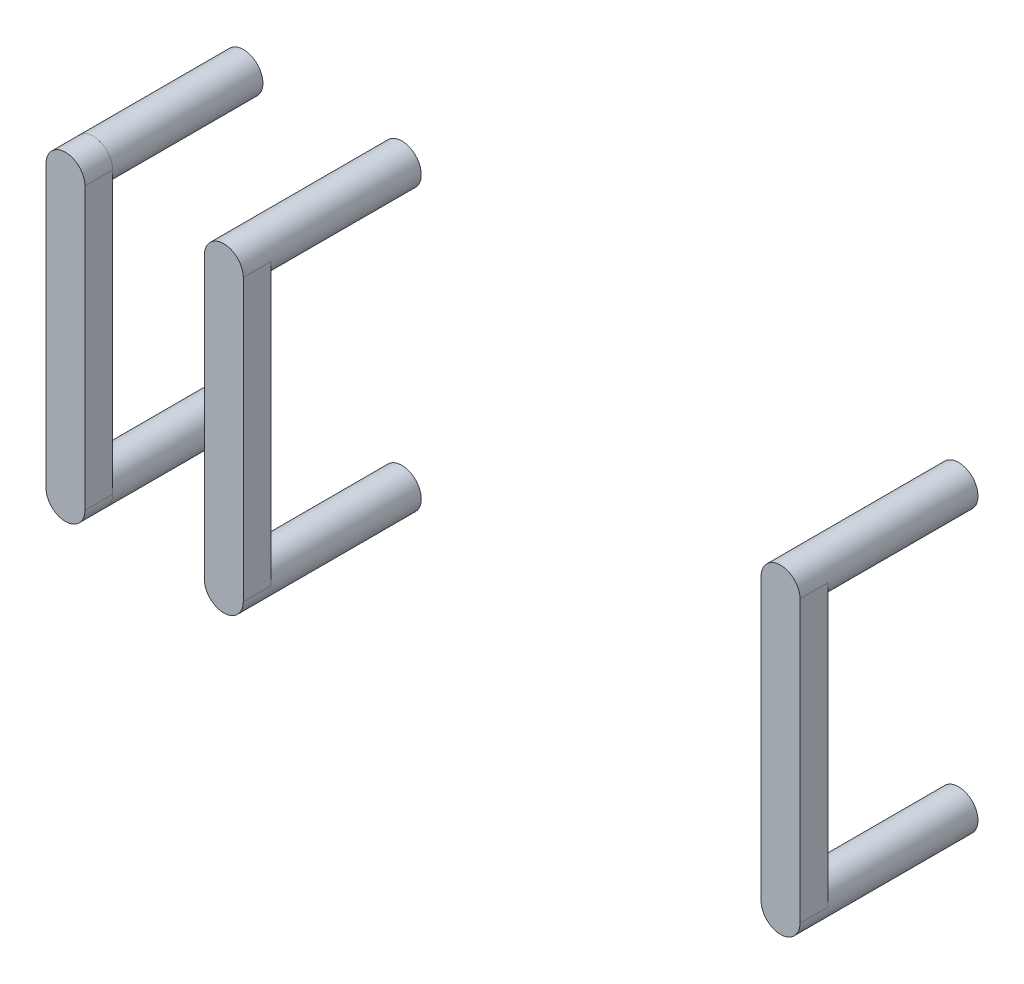
ISO-10303-21;
HEADER;
FILE_DESCRIPTION(('STEP AP214'),'2;1');
FILE_NAME('part.step','',(''),(''),'','','');
FILE_SCHEMA(('AUTOMOTIVE_DESIGN { 1 0 10303 214 1 1 1 1 }'));
ENDSEC;
DATA;
#1=APPLICATION_CONTEXT('core data for automotive mechanical design processes');
#2=APPLICATION_PROTOCOL_DEFINITION('international standard','automotive_design',2000,#1);
#3=PRODUCT_CONTEXT('',#1,'mechanical');
#4=PRODUCT('Part','Part','',(#3));
#5=PRODUCT_RELATED_PRODUCT_CATEGORY('part','',(#4));
#6=PRODUCT_DEFINITION_FORMATION('','',#4);
#7=PRODUCT_DEFINITION_CONTEXT('part definition',#1,'design');
#8=PRODUCT_DEFINITION('design','',#6,#7);
#9=PRODUCT_DEFINITION_SHAPE('','',#8);
#10=(LENGTH_UNIT() NAMED_UNIT(*) SI_UNIT(.MILLI.,.METRE.));
#11=(NAMED_UNIT(*) PLANE_ANGLE_UNIT() SI_UNIT($,.RADIAN.));
#12=(NAMED_UNIT(*) SI_UNIT($,.STERADIAN.) SOLID_ANGLE_UNIT());
#13=UNCERTAINTY_MEASURE_WITH_UNIT(LENGTH_MEASURE(1.E-05),#10,'distance_accuracy_value','');
#14=(GEOMETRIC_REPRESENTATION_CONTEXT(3) GLOBAL_UNCERTAINTY_ASSIGNED_CONTEXT((#13)) GLOBAL_UNIT_ASSIGNED_CONTEXT((#10,
#11,#12)) REPRESENTATION_CONTEXT('',''));
#15=CARTESIAN_POINT('',(0.,0.,0.));
#16=DIRECTION('',(0.,0.,1.));
#17=DIRECTION('',(1.,0.,0.));
#18=AXIS2_PLACEMENT_3D('',#15,#16,#17);
#19=CARTESIAN_POINT('',(-78.5249999999999,-80.2018973444951,31.9999999999999));
#20=DIRECTION('',(0.,0.,-1.));
#21=DIRECTION('',(-1.,0.,0.));
#22=AXIS2_PLACEMENT_3D('',#19,#20,#21);
#23=CYLINDRICAL_SURFACE('',#22,3.5);
#24=CARTESIAN_POINT('',(-78.5249999999999,-80.2018973444951,26.9999999999999));
#25=DIRECTION('',(0.,0.,1.));
#26=DIRECTION('',(-1.,0.,0.));
#27=AXIS2_PLACEMENT_3D('',#24,#25,#26);
#28=CIRCLE('',#27,3.5);
#29=CARTESIAN_POINT('',(-82.0249999999999,-80.2018973444951,26.9999999999999));
#30=VERTEX_POINT('',#29);
#31=CARTESIAN_POINT('',(-75.0249999999999,-80.2018973444951,26.9999999999999));
#32=VERTEX_POINT('',#31);
#33=EDGE_CURVE('E12',#30,#32,#28,.T.);
#34=ORIENTED_EDGE('',*,*,#33,.T.);
#35=DIRECTION('',(0.,0.,-1.));
#36=VECTOR('',#35,1.);
#37=CARTESIAN_POINT('',(-75.0249999999999,-80.2018973444951,31.9999999999999));
#38=LINE('',#37,#36);
#39=CARTESIAN_POINT('',(-75.0249999999999,-80.2018973444951,31.9999999999999));
#40=VERTEX_POINT('',#39);
#41=EDGE_CURVE('E117',#40,#32,#38,.T.);
#42=ORIENTED_EDGE('',*,*,#41,.F.);
#43=CARTESIAN_POINT('',(-78.5249999999999,-80.2018973444951,31.9999999999999));
#44=DIRECTION('',(0.,0.,1.));
#45=DIRECTION('',(-1.,0.,0.));
#46=AXIS2_PLACEMENT_3D('',#43,#44,#45);
#47=CIRCLE('',#46,3.5);
#48=CARTESIAN_POINT('',(-82.0249999999999,-80.2018973444951,31.9999999999999));
#49=VERTEX_POINT('',#48);
#50=EDGE_CURVE('E50',#49,#40,#47,.T.);
#51=ORIENTED_EDGE('',*,*,#50,.F.);
#52=DIRECTION('',(0.,0.,-1.));
#53=VECTOR('',#52,1.);
#54=CARTESIAN_POINT('',(-82.0249999999999,-80.2018973444951,31.9999999999999));
#55=LINE('',#54,#53);
#56=EDGE_CURVE('E105',#49,#30,#55,.T.);
#57=ORIENTED_EDGE('',*,*,#56,.T.);
#58=EDGE_LOOP('',(#34,#42,#51,#57));
#59=FACE_BOUND('',#58,.T.);
#60=ADVANCED_FACE('F46',(#59),#23,.T.);
#61=CARTESIAN_POINT('',(-75.0249999999999,-80.2018973444951,31.9999999999999));
#62=DIRECTION('',(-1.,0.,0.));
#63=DIRECTION('',(0.,-1.,0.));
#64=AXIS2_PLACEMENT_3D('',#61,#62,#63);
#65=PLANE('',#64);
#66=DIRECTION('',(0.,1.,0.));
#67=VECTOR('',#66,1.);
#68=CARTESIAN_POINT('',(-75.0249999999999,-80.2018973444951,26.9999999999999));
#69=LINE('',#68,#67);
#70=CARTESIAN_POINT('',(-75.0249999999999,-29.6981026555043,26.9999999999999));
#71=VERTEX_POINT('',#70);
#72=EDGE_CURVE('E56',#32,#71,#69,.T.);
#73=ORIENTED_EDGE('',*,*,#72,.T.);
#74=DIRECTION('',(0.,0.,-1.));
#75=VECTOR('',#74,1.);
#76=CARTESIAN_POINT('',(-75.0249999999999,-29.6981026555043,31.9999999999999));
#77=LINE('',#76,#75);
#78=CARTESIAN_POINT('',(-75.0249999999999,-29.6981026555043,31.9999999999999));
#79=VERTEX_POINT('',#78);
#80=EDGE_CURVE('E101',#79,#71,#77,.T.);
#81=ORIENTED_EDGE('',*,*,#80,.F.);
#82=DIRECTION('',(0.,1.,0.));
#83=VECTOR('',#82,1.);
#84=CARTESIAN_POINT('',(-75.0249999999999,-80.2018973444951,31.9999999999999));
#85=LINE('',#84,#83);
#86=EDGE_CURVE('E80',#40,#79,#85,.T.);
#87=ORIENTED_EDGE('',*,*,#86,.F.);
#88=ORIENTED_EDGE('',*,*,#41,.T.);
#89=EDGE_LOOP('',(#73,#81,#87,#88));
#90=FACE_BOUND('',#89,.T.);
#91=ADVANCED_FACE('F120',(#90),#65,.F.);
#92=CARTESIAN_POINT('',(-78.5249999999999,-29.6981026555043,31.9999999999999));
#93=DIRECTION('',(0.,0.,-1.));
#94=DIRECTION('',(-1.,0.,0.));
#95=AXIS2_PLACEMENT_3D('',#92,#93,#94);
#96=CYLINDRICAL_SURFACE('',#95,3.5);
#97=CARTESIAN_POINT('',(-78.5249999999999,-29.6981026555043,26.9999999999999));
#98=DIRECTION('',(0.,0.,1.));
#99=DIRECTION('',(1.,0.,0.));
#100=AXIS2_PLACEMENT_3D('',#97,#98,#99);
#101=CIRCLE('',#100,3.5);
#102=CARTESIAN_POINT('',(-82.0249999999999,-29.6981026555043,26.9999999999999));
#103=VERTEX_POINT('',#102);
#104=EDGE_CURVE('E96',#71,#103,#101,.T.);
#105=ORIENTED_EDGE('',*,*,#104,.T.);
#106=DIRECTION('',(0.,0.,-1.));
#107=VECTOR('',#106,1.);
#108=CARTESIAN_POINT('',(-82.0249999999999,-29.6981026555043,31.9999999999999));
#109=LINE('',#108,#107);
#110=CARTESIAN_POINT('',(-82.0249999999999,-29.6981026555043,31.9999999999999));
#111=VERTEX_POINT('',#110);
#112=EDGE_CURVE('E99',#111,#103,#109,.T.);
#113=ORIENTED_EDGE('',*,*,#112,.F.);
#114=CARTESIAN_POINT('',(-78.5249999999999,-29.6981026555043,31.9999999999999));
#115=DIRECTION('',(0.,0.,1.));
#116=DIRECTION('',(1.,0.,0.));
#117=AXIS2_PLACEMENT_3D('',#114,#115,#116);
#118=CIRCLE('',#117,3.5);
#119=EDGE_CURVE('E113',#79,#111,#118,.T.);
#120=ORIENTED_EDGE('',*,*,#119,.F.);
#121=ORIENTED_EDGE('',*,*,#80,.T.);
#122=EDGE_LOOP('',(#105,#113,#120,#121));
#123=FACE_BOUND('',#122,.T.);
#124=ADVANCED_FACE('F97',(#123),#96,.T.);
#125=CARTESIAN_POINT('',(-82.0249999999999,-29.6981026555043,31.9999999999999));
#126=DIRECTION('',(1.,0.,0.));
#127=DIRECTION('',(0.,0.,-1.));
#128=AXIS2_PLACEMENT_3D('',#125,#126,#127);
#129=PLANE('',#128);
#130=DIRECTION('',(0.,-1.,0.));
#131=VECTOR('',#130,1.);
#132=CARTESIAN_POINT('',(-82.0249999999999,-29.6981026555043,26.9999999999999));
#133=LINE('',#132,#131);
#134=EDGE_CURVE('E90',#103,#30,#133,.T.);
#135=ORIENTED_EDGE('',*,*,#134,.T.);
#136=ORIENTED_EDGE('',*,*,#56,.F.);
#137=DIRECTION('',(0.,-1.,0.));
#138=VECTOR('',#137,1.);
#139=CARTESIAN_POINT('',(-82.0249999999999,-29.6981026555043,31.9999999999999));
#140=LINE('',#139,#138);
#141=EDGE_CURVE('E104',#111,#49,#140,.T.);
#142=ORIENTED_EDGE('',*,*,#141,.F.);
#143=ORIENTED_EDGE('',*,*,#112,.T.);
#144=EDGE_LOOP('',(#135,#136,#142,#143));
#145=FACE_BOUND('',#144,.T.);
#146=ADVANCED_FACE('F103',(#145),#129,.F.);
#147=CARTESIAN_POINT('',(-78.5249999999999,-80.2018973444951,31.9999999999999));
#148=DIRECTION('',(0.,0.,-1.));
#149=DIRECTION('',(-1.,0.,0.));
#150=AXIS2_PLACEMENT_3D('',#147,#148,#149);
#151=PLANE('',#150);
#152=ORIENTED_EDGE('',*,*,#50,.T.);
#153=ORIENTED_EDGE('',*,*,#86,.T.);
#154=ORIENTED_EDGE('',*,*,#119,.T.);
#155=ORIENTED_EDGE('',*,*,#141,.T.);
#156=EDGE_LOOP('',(#152,#153,#154,#155));
#157=FACE_BOUND('',#156,.T.);
#158=ADVANCED_FACE('F48',(#157),#151,.F.);
#159=CARTESIAN_POINT('',(-78.5249999999999,-80.2018973444951,26.9999999999999));
#160=DIRECTION('',(0.,0.,-1.));
#161=DIRECTION('',(-1.,0.,0.));
#162=AXIS2_PLACEMENT_3D('',#159,#160,#161);
#163=PLANE('',#162);
#164=ORIENTED_EDGE('',*,*,#33,.F.);
#165=ORIENTED_EDGE('',*,*,#134,.F.);
#166=ORIENTED_EDGE('',*,*,#104,.F.);
#167=ORIENTED_EDGE('',*,*,#72,.F.);
#168=EDGE_LOOP('',(#164,#165,#166,#167));
#169=FACE_BOUND('',#168,.T.);
#170=ADVANCED_FACE('F107',(#169),#163,.T.);
#171=CLOSED_SHELL('',(#60,#91,#124,#146,#158,#170));
#172=MANIFOLD_SOLID_BREP('B2',#171);
#173=CARTESIAN_POINT('',(-78.5249999999999,-29.6981026555043,36.8994949366116));
#174=DIRECTION('',(0.,0.,-1.));
#175=DIRECTION('',(-1.,0.,0.));
#176=AXIS2_PLACEMENT_3D('',#173,#174,#175);
#177=CYLINDRICAL_SURFACE('',#176,3.50000000000001);
#178=CARTESIAN_POINT('',(-78.5249999999999,-29.6981026555043,0.));
#179=DIRECTION('',(0.,0.,1.));
#180=DIRECTION('',(1.,0.,0.));
#181=AXIS2_PLACEMENT_3D('',#178,#179,#180);
#182=CIRCLE('',#181,3.50000000000001);
#183=CARTESIAN_POINT('',(-75.0249999999999,-29.6981026555043,0.));
#184=VERTEX_POINT('',#183);
#185=EDGE_CURVE('E45',#184,#184,#182,.T.);
#186=ORIENTED_EDGE('',*,*,#185,.T.);
#187=EDGE_LOOP('',(#186));
#188=FACE_BOUND('',#187,.T.);
#189=CARTESIAN_POINT('',(-78.5249999999999,-29.6981026555043,26.9999999999999));
#190=DIRECTION('',(0.,0.,1.));
#191=DIRECTION('',(1.,0.,0.));
#192=AXIS2_PLACEMENT_3D('',#189,#190,#191);
#193=CIRCLE('',#192,3.50000000000001);
#194=CARTESIAN_POINT('',(-75.0249999999999,-29.6981026555043,26.9999999999999));
#195=VERTEX_POINT('',#194);
#196=EDGE_CURVE('E197',#195,#195,#193,.T.);
#197=ORIENTED_EDGE('',*,*,#196,.F.);
#198=EDGE_LOOP('',(#197));
#199=FACE_BOUND('',#198,.T.);
#200=ADVANCED_FACE('F190',(#188,#199),#177,.T.);
#201=CARTESIAN_POINT('',(-78.5249999999999,-29.6981026555043,0.));
#202=DIRECTION('',(0.,0.,1.));
#203=DIRECTION('',(1.,0.,0.));
#204=AXIS2_PLACEMENT_3D('',#201,#202,#203);
#205=PLANE('',#204);
#206=ORIENTED_EDGE('',*,*,#185,.F.);
#207=EDGE_LOOP('',(#206));
#208=FACE_BOUND('',#207,.T.);
#209=ADVANCED_FACE('F192',(#208),#205,.F.);
#210=CARTESIAN_POINT('',(0.,-3.99999999999997,26.9999999999999));
#211=DIRECTION('',(0.,0.,1.));
#212=DIRECTION('',(1.,0.,0.));
#213=AXIS2_PLACEMENT_3D('',#210,#211,#212);
#214=PLANE('',#213);
#215=ORIENTED_EDGE('',*,*,#196,.T.);
#216=EDGE_LOOP('',(#215));
#217=FACE_BOUND('',#216,.T.);
#218=ADVANCED_FACE('F203',(#217),#214,.T.);
#219=CLOSED_SHELL('',(#200,#209,#218));
#220=MANIFOLD_SOLID_BREP('B6',#219);
#221=CARTESIAN_POINT('',(-78.5249999999999,-80.2018973444951,36.8994949366116));
#222=DIRECTION('',(0.,0.,-1.));
#223=DIRECTION('',(-1.,0.,0.));
#224=AXIS2_PLACEMENT_3D('',#221,#222,#223);
#225=CYLINDRICAL_SURFACE('',#224,3.50000000000001);
#226=CARTESIAN_POINT('',(-78.5249999999999,-80.2018973444951,0.));
#227=DIRECTION('',(0.,0.,1.));
#228=DIRECTION('',(-1.,0.,0.));
#229=AXIS2_PLACEMENT_3D('',#226,#227,#228);
#230=CIRCLE('',#229,3.50000000000001);
#231=CARTESIAN_POINT('',(-82.0249999999999,-80.2018973444951,0.));
#232=VERTEX_POINT('',#231);
#233=EDGE_CURVE('E189',#232,#232,#230,.T.);
#234=ORIENTED_EDGE('',*,*,#233,.T.);
#235=EDGE_LOOP('',(#234));
#236=FACE_BOUND('',#235,.T.);
#237=CARTESIAN_POINT('',(-78.5249999999999,-80.2018973444951,26.9999999999999));
#238=DIRECTION('',(0.,0.,1.));
#239=DIRECTION('',(1.,0.,0.));
#240=AXIS2_PLACEMENT_3D('',#237,#238,#239);
#241=CIRCLE('',#240,3.50000000000001);
#242=CARTESIAN_POINT('',(-75.0249999999999,-80.2018973444951,26.9999999999999));
#243=VERTEX_POINT('',#242);
#244=EDGE_CURVE('E254',#243,#243,#241,.T.);
#245=ORIENTED_EDGE('',*,*,#244,.F.);
#246=EDGE_LOOP('',(#245));
#247=FACE_BOUND('',#246,.T.);
#248=ADVANCED_FACE('F247',(#236,#247),#225,.T.);
#249=CARTESIAN_POINT('',(-78.5249999999999,-80.2018973444951,0.));
#250=DIRECTION('',(0.,0.,-1.));
#251=DIRECTION('',(-1.,0.,0.));
#252=AXIS2_PLACEMENT_3D('',#249,#250,#251);
#253=PLANE('',#252);
#254=ORIENTED_EDGE('',*,*,#233,.F.);
#255=EDGE_LOOP('',(#254));
#256=FACE_BOUND('',#255,.T.);
#257=ADVANCED_FACE('F249',(#256),#253,.T.);
#258=CARTESIAN_POINT('',(0.,-3.99999999999997,26.9999999999999));
#259=DIRECTION('',(0.,0.,1.));
#260=DIRECTION('',(1.,0.,0.));
#261=AXIS2_PLACEMENT_3D('',#258,#259,#260);
#262=PLANE('',#261);
#263=ORIENTED_EDGE('',*,*,#244,.T.);
#264=EDGE_LOOP('',(#263));
#265=FACE_BOUND('',#264,.T.);
#266=ADVANCED_FACE('F260',(#265),#262,.T.);
#267=CLOSED_SHELL('',(#248,#257,#266));
#268=MANIFOLD_SOLID_BREP('B40',#267);
#269=CARTESIAN_POINT('',(50.0500000000049,-80.2018973444951,26.9999999999999));
#270=DIRECTION('',(0.,0.,-1.));
#271=DIRECTION('',(-1.,0.,0.));
#272=AXIS2_PLACEMENT_3D('',#269,#270,#271);
#273=PLANE('',#272);
#274=DIRECTION('',(0.,-1.,0.));
#275=VECTOR('',#274,1.);
#276=CARTESIAN_POINT('',(46.5500000000049,-29.6981026555043,26.9999999999999));
#277=LINE('',#276,#275);
#278=CARTESIAN_POINT('',(46.5500000000049,-29.6981026555043,26.9999999999999));
#279=VERTEX_POINT('',#278);
#280=CARTESIAN_POINT('',(46.5500000000049,-80.2018973444951,26.9999999999999));
#281=VERTEX_POINT('',#280);
#282=EDGE_CURVE('E360',#279,#281,#277,.T.);
#283=ORIENTED_EDGE('',*,*,#282,.F.);
#284=CARTESIAN_POINT('',(50.050000000005,-29.6981026555043,26.9999999999999));
#285=DIRECTION('',(0.,0.,-1.));
#286=DIRECTION('',(-1.,0.,0.));
#287=AXIS2_PLACEMENT_3D('',#284,#285,#286);
#288=CIRCLE('',#287,3.5);
#289=CARTESIAN_POINT('',(53.550000000005,-29.6981026555043,26.9999999999999));
#290=VERTEX_POINT('',#289);
#291=EDGE_CURVE('E245',#279,#290,#288,.F.);
#292=ORIENTED_EDGE('',*,*,#291,.T.);
#293=DIRECTION('',(0.,1.,0.));
#294=VECTOR('',#293,1.);
#295=CARTESIAN_POINT('',(53.5500000000049,-80.2018973444951,26.9999999999999));
#296=LINE('',#295,#294);
#297=CARTESIAN_POINT('',(53.5500000000049,-80.2018973444951,26.9999999999999));
#298=VERTEX_POINT('',#297);
#299=EDGE_CURVE('E377',#298,#290,#296,.T.);
#300=ORIENTED_EDGE('',*,*,#299,.F.);
#301=CARTESIAN_POINT('',(50.050000000005,-80.2018973444951,26.9999999999999));
#302=DIRECTION('',(0.,0.,1.));
#303=DIRECTION('',(1.,0.,0.));
#304=AXIS2_PLACEMENT_3D('',#301,#302,#303);
#305=CIRCLE('',#304,3.5);
#306=EDGE_CURVE('E318',#298,#281,#305,.T.);
#307=ORIENTED_EDGE('',*,*,#306,.T.);
#308=EDGE_LOOP('',(#283,#292,#300,#307));
#309=FACE_BOUND('',#308,.T.);
#310=ADVANCED_FACE('F303',(#309),#273,.T.);
#311=CARTESIAN_POINT('',(50.050000000005,-80.2018973444951,36.8994949366116));
#312=DIRECTION('',(0.,0.,-1.));
#313=DIRECTION('',(-1.,0.,0.));
#314=AXIS2_PLACEMENT_3D('',#311,#312,#313);
#315=CYLINDRICAL_SURFACE('',#314,3.5);
#316=CARTESIAN_POINT('',(50.050000000005,-80.2018973444951,0.));
#317=DIRECTION('',(0.,0.,1.));
#318=DIRECTION('',(-1.,0.,0.));
#319=AXIS2_PLACEMENT_3D('',#316,#317,#318);
#320=CIRCLE('',#319,3.5);
#321=CARTESIAN_POINT('',(46.550000000005,-80.2018973444951,0.));
#322=VERTEX_POINT('',#321);
#323=EDGE_CURVE('E311',#322,#322,#320,.T.);
#324=ORIENTED_EDGE('',*,*,#323,.T.);
#325=EDGE_LOOP('',(#324));
#326=FACE_BOUND('',#325,.T.);
#327=ORIENTED_EDGE('',*,*,#306,.F.);
#328=DIRECTION('',(0.,0.,-1.));
#329=VECTOR('',#328,1.);
#330=CARTESIAN_POINT('',(53.5500000000049,-80.2018973444951,31.9999999999999));
#331=LINE('',#330,#329);
#332=CARTESIAN_POINT('',(53.5500000000049,-80.2018973444951,31.9999999999999));
#333=VERTEX_POINT('',#332);
#334=EDGE_CURVE('E347',#333,#298,#331,.T.);
#335=ORIENTED_EDGE('',*,*,#334,.F.);
#336=CARTESIAN_POINT('',(50.0500000000049,-80.2018973444951,31.9999999999999));
#337=DIRECTION('',(0.,0.,1.));
#338=DIRECTION('',(-1.,0.,0.));
#339=AXIS2_PLACEMENT_3D('',#336,#337,#338);
#340=CIRCLE('',#339,3.5);
#341=CARTESIAN_POINT('',(46.5500000000049,-80.2018973444951,31.9999999999999));
#342=VERTEX_POINT('',#341);
#343=EDGE_CURVE('E352',#342,#333,#340,.T.);
#344=ORIENTED_EDGE('',*,*,#343,.F.);
#345=DIRECTION('',(0.,0.,-1.));
#346=VECTOR('',#345,1.);
#347=CARTESIAN_POINT('',(46.5500000000049,-80.2018973444951,31.9999999999999));
#348=LINE('',#347,#346);
#349=EDGE_CURVE('E374',#342,#281,#348,.T.);
#350=ORIENTED_EDGE('',*,*,#349,.T.);
#351=EDGE_LOOP('',(#327,#335,#344,#350));
#352=FACE_BOUND('',#351,.T.);
#353=ADVANCED_FACE('F362',(#326,#352),#315,.T.);
#354=CARTESIAN_POINT('',(50.050000000005,-80.2018973444951,0.));
#355=DIRECTION('',(0.,0.,-1.));
#356=DIRECTION('',(-1.,0.,0.));
#357=AXIS2_PLACEMENT_3D('',#354,#355,#356);
#358=PLANE('',#357);
#359=CARTESIAN_POINT('',(50.0500000000049,-80.2018973444951,0.));
#360=DIRECTION('',(0.,0.,-1.));
#361=DIRECTION('',(1.,0.,0.));
#362=AXIS2_PLACEMENT_3D('',#359,#360,#361);
#363=CIRCLE('',#362,2.1);
#364=CARTESIAN_POINT('',(52.150000000005,-80.2018973444951,0.));
#365=VERTEX_POINT('',#364);
#366=EDGE_CURVE('E382',#365,#365,#363,.T.);
#367=ORIENTED_EDGE('',*,*,#366,.F.);
#368=EDGE_LOOP('',(#367));
#369=FACE_BOUND('',#368,.T.);
#370=ORIENTED_EDGE('',*,*,#323,.F.);
#371=EDGE_LOOP('',(#370));
#372=FACE_BOUND('',#371,.T.);
#373=ADVANCED_FACE('F305',(#369,#372),#358,.T.);
#374=CARTESIAN_POINT('',(50.0500000000049,-80.2018973444951,5.7));
#375=DIRECTION('',(0.,0.,-1.));
#376=DIRECTION('',(-1.,0.,0.));
#377=AXIS2_PLACEMENT_3D('',#374,#375,#376);
#378=CYLINDRICAL_SURFACE('',#377,2.1);
#379=CARTESIAN_POINT('',(50.0500000000049,-80.2018973444951,5.7));
#380=DIRECTION('',(0.,0.,-1.));
#381=DIRECTION('',(1.,0.,0.));
#382=AXIS2_PLACEMENT_3D('',#379,#380,#381);
#383=CIRCLE('',#382,2.1);
#384=CARTESIAN_POINT('',(52.150000000005,-80.2018973444951,5.7));
#385=VERTEX_POINT('',#384);
#386=EDGE_CURVE('E379',#385,#385,#383,.T.);
#387=ORIENTED_EDGE('',*,*,#386,.F.);
#388=EDGE_LOOP('',(#387));
#389=FACE_BOUND('',#388,.T.);
#390=ORIENTED_EDGE('',*,*,#366,.T.);
#391=EDGE_LOOP('',(#390));
#392=FACE_BOUND('',#391,.T.);
#393=ADVANCED_FACE('F392',(#389,#392),#378,.F.);
#394=CARTESIAN_POINT('',(50.0500000000049,-80.2018973444951,5.7));
#395=DIRECTION('',(0.,0.,1.));
#396=DIRECTION('',(1.,0.,0.));
#397=AXIS2_PLACEMENT_3D('',#394,#395,#396);
#398=PLANE('',#397);
#399=ORIENTED_EDGE('',*,*,#386,.T.);
#400=EDGE_LOOP('',(#399));
#401=FACE_BOUND('',#400,.T.);
#402=ADVANCED_FACE('F398',(#401),#398,.F.);
#403=CARTESIAN_POINT('',(53.5500000000049,-80.2018973444951,31.9999999999999));
#404=DIRECTION('',(-1.,0.,0.));
#405=DIRECTION('',(0.,-1.,0.));
#406=AXIS2_PLACEMENT_3D('',#403,#404,#405);
#407=PLANE('',#406);
#408=ORIENTED_EDGE('',*,*,#299,.T.);
#409=DIRECTION('',(0.,0.,-1.));
#410=VECTOR('',#409,1.);
#411=CARTESIAN_POINT('',(53.5500000000049,-29.6981026555043,31.9999999999999));
#412=LINE('',#411,#410);
#413=CARTESIAN_POINT('',(53.5500000000049,-29.6981026555043,31.9999999999999));
#414=VERTEX_POINT('',#413);
#415=EDGE_CURVE('E349',#414,#290,#412,.T.);
#416=ORIENTED_EDGE('',*,*,#415,.F.);
#417=DIRECTION('',(0.,1.,0.));
#418=VECTOR('',#417,1.);
#419=CARTESIAN_POINT('',(53.5500000000049,-80.2018973444951,31.9999999999999));
#420=LINE('',#419,#418);
#421=EDGE_CURVE('E343',#333,#414,#420,.T.);
#422=ORIENTED_EDGE('',*,*,#421,.F.);
#423=ORIENTED_EDGE('',*,*,#334,.T.);
#424=EDGE_LOOP('',(#408,#416,#422,#423));
#425=FACE_BOUND('',#424,.T.);
#426=ADVANCED_FACE('F346',(#425),#407,.F.);
#427=CARTESIAN_POINT('',(50.0500000000049,-29.6981026555043,31.9999999999999));
#428=DIRECTION('',(0.,0.,-1.));
#429=DIRECTION('',(-1.,0.,0.));
#430=AXIS2_PLACEMENT_3D('',#427,#428,#429);
#431=CYLINDRICAL_SURFACE('',#430,3.5);
#432=ORIENTED_EDGE('',*,*,#415,.T.);
#433=ORIENTED_EDGE('',*,*,#291,.F.);
#434=DIRECTION('',(0.,0.,-1.));
#435=VECTOR('',#434,1.);
#436=CARTESIAN_POINT('',(46.5500000000049,-29.6981026555043,31.9999999999999));
#437=LINE('',#436,#435);
#438=CARTESIAN_POINT('',(46.5500000000049,-29.6981026555043,31.9999999999999));
#439=VERTEX_POINT('',#438);
#440=EDGE_CURVE('E365',#439,#279,#437,.T.);
#441=ORIENTED_EDGE('',*,*,#440,.F.);
#442=CARTESIAN_POINT('',(50.0500000000049,-29.6981026555043,31.9999999999999));
#443=DIRECTION('',(0.,0.,1.));
#444=DIRECTION('',(1.,0.,0.));
#445=AXIS2_PLACEMENT_3D('',#442,#443,#444);
#446=CIRCLE('',#445,3.5);
#447=EDGE_CURVE('E353',#414,#439,#446,.T.);
#448=ORIENTED_EDGE('',*,*,#447,.F.);
#449=EDGE_LOOP('',(#432,#433,#441,#448));
#450=FACE_BOUND('',#449,.T.);
#451=CARTESIAN_POINT('',(50.050000000005,-29.6981026555043,0.));
#452=DIRECTION('',(0.,0.,1.));
#453=DIRECTION('',(1.,0.,0.));
#454=AXIS2_PLACEMENT_3D('',#451,#452,#453);
#455=CIRCLE('',#454,3.5);
#456=CARTESIAN_POINT('',(53.550000000005,-29.6981026555043,0.));
#457=VERTEX_POINT('',#456);
#458=EDGE_CURVE('E363',#457,#457,#455,.T.);
#459=ORIENTED_EDGE('',*,*,#458,.T.);
#460=EDGE_LOOP('',(#459));
#461=FACE_BOUND('',#460,.T.);
#462=ADVANCED_FACE('F418',(#450,#461),#431,.T.);
#463=CARTESIAN_POINT('',(46.5500000000049,-29.6981026555043,31.9999999999999));
#464=DIRECTION('',(1.,0.,0.));
#465=DIRECTION('',(0.,1.,0.));
#466=AXIS2_PLACEMENT_3D('',#463,#464,#465);
#467=PLANE('',#466);
#468=ORIENTED_EDGE('',*,*,#282,.T.);
#469=ORIENTED_EDGE('',*,*,#349,.F.);
#470=DIRECTION('',(0.,-1.,0.));
#471=VECTOR('',#470,1.);
#472=CARTESIAN_POINT('',(46.5500000000049,-29.6981026555043,31.9999999999999));
#473=LINE('',#472,#471);
#474=EDGE_CURVE('E358',#439,#342,#473,.T.);
#475=ORIENTED_EDGE('',*,*,#474,.F.);
#476=ORIENTED_EDGE('',*,*,#440,.T.);
#477=EDGE_LOOP('',(#468,#469,#475,#476));
#478=FACE_BOUND('',#477,.T.);
#479=ADVANCED_FACE('F408',(#478),#467,.F.);
#480=CARTESIAN_POINT('',(50.0500000000049,-80.2018973444951,31.9999999999999));
#481=DIRECTION('',(0.,0.,-1.));
#482=DIRECTION('',(-1.,0.,0.));
#483=AXIS2_PLACEMENT_3D('',#480,#481,#482);
#484=PLANE('',#483);
#485=ORIENTED_EDGE('',*,*,#343,.T.);
#486=ORIENTED_EDGE('',*,*,#421,.T.);
#487=ORIENTED_EDGE('',*,*,#447,.T.);
#488=ORIENTED_EDGE('',*,*,#474,.T.);
#489=EDGE_LOOP('',(#485,#486,#487,#488));
#490=FACE_BOUND('',#489,.T.);
#491=ADVANCED_FACE('F356',(#490),#484,.F.);
#492=CARTESIAN_POINT('',(50.050000000005,-29.6981026555043,0.));
#493=DIRECTION('',(0.,0.,1.));
#494=DIRECTION('',(1.,0.,0.));
#495=AXIS2_PLACEMENT_3D('',#492,#493,#494);
#496=PLANE('',#495);
#497=CARTESIAN_POINT('',(50.0500000000049,-29.6981026555043,0.));
#498=DIRECTION('',(0.,0.,-1.));
#499=DIRECTION('',(-1.,0.,0.));
#500=AXIS2_PLACEMENT_3D('',#497,#498,#499);
#501=CIRCLE('',#500,2.1);
#502=CARTESIAN_POINT('',(47.950000000005,-29.6981026555043,0.));
#503=VERTEX_POINT('',#502);
#504=EDGE_CURVE('E368',#503,#503,#501,.T.);
#505=ORIENTED_EDGE('',*,*,#504,.F.);
#506=EDGE_LOOP('',(#505));
#507=FACE_BOUND('',#506,.T.);
#508=ORIENTED_EDGE('',*,*,#458,.F.);
#509=EDGE_LOOP('',(#508));
#510=FACE_BOUND('',#509,.T.);
#511=ADVANCED_FACE('F411',(#507,#510),#496,.F.);
#512=CARTESIAN_POINT('',(50.0500000000049,-29.6981026555043,5.7));
#513=DIRECTION('',(0.,0.,-1.));
#514=DIRECTION('',(-1.,0.,0.));
#515=AXIS2_PLACEMENT_3D('',#512,#513,#514);
#516=CYLINDRICAL_SURFACE('',#515,2.1);
#517=CARTESIAN_POINT('',(50.0500000000049,-29.6981026555043,5.7));
#518=DIRECTION('',(0.,0.,-1.));
#519=DIRECTION('',(-1.,0.,0.));
#520=AXIS2_PLACEMENT_3D('',#517,#518,#519);
#521=CIRCLE('',#520,2.1);
#522=CARTESIAN_POINT('',(47.950000000005,-29.6981026555043,5.7));
#523=VERTEX_POINT('',#522);
#524=EDGE_CURVE('E442',#523,#523,#521,.T.);
#525=ORIENTED_EDGE('',*,*,#524,.F.);
#526=EDGE_LOOP('',(#525));
#527=FACE_BOUND('',#526,.T.);
#528=ORIENTED_EDGE('',*,*,#504,.T.);
#529=EDGE_LOOP('',(#528));
#530=FACE_BOUND('',#529,.T.);
#531=ADVANCED_FACE('F429',(#527,#530),#516,.F.);
#532=CARTESIAN_POINT('',(50.0500000000049,-29.6981026555043,5.7));
#533=DIRECTION('',(0.,0.,-1.));
#534=DIRECTION('',(-1.,0.,0.));
#535=AXIS2_PLACEMENT_3D('',#532,#533,#534);
#536=PLANE('',#535);
#537=ORIENTED_EDGE('',*,*,#524,.T.);
#538=EDGE_LOOP('',(#537));
#539=FACE_BOUND('',#538,.T.);
#540=ADVANCED_FACE('F431',(#539),#536,.T.);
#541=CLOSED_SHELL('',(#310,#353,#373,#393,#402,#426,#462,#479,#491,#511,#531,#540));
#542=MANIFOLD_SOLID_BREP('B184',#541);
#543=CARTESIAN_POINT('',(-50.0500000000049,-80.2018973444951,26.9999999999999));
#544=DIRECTION('',(0.,0.,1.));
#545=DIRECTION('',(1.,0.,0.));
#546=AXIS2_PLACEMENT_3D('',#543,#544,#545);
#547=PLANE('',#546);
#548=CARTESIAN_POINT('',(-50.0500000000049,-29.6981026555043,26.9999999999999));
#549=DIRECTION('',(0.,0.,1.));
#550=DIRECTION('',(1.,0.,0.));
#551=AXIS2_PLACEMENT_3D('',#548,#549,#550);
#552=CIRCLE('',#551,3.5);
#553=CARTESIAN_POINT('',(-53.5500000000049,-29.6981026555043,26.9999999999999));
#554=VERTEX_POINT('',#553);
#555=CARTESIAN_POINT('',(-46.5500000000049,-29.6981026555043,26.9999999999999));
#556=VERTEX_POINT('',#555);
#557=EDGE_CURVE('E584',#554,#556,#552,.T.);
#558=ORIENTED_EDGE('',*,*,#557,.T.);
#559=DIRECTION('',(0.,1.,0.));
#560=VECTOR('',#559,1.);
#561=CARTESIAN_POINT('',(-46.5500000000049,-29.6981026555043,26.9999999999999));
#562=LINE('',#561,#560);
#563=CARTESIAN_POINT('',(-46.5500000000049,-80.2018973444951,26.9999999999999));
#564=VERTEX_POINT('',#563);
#565=EDGE_CURVE('E595',#564,#556,#562,.T.);
#566=ORIENTED_EDGE('',*,*,#565,.F.);
#567=CARTESIAN_POINT('',(-50.0500000000049,-80.2018973444951,26.9999999999999));
#568=DIRECTION('',(0.,0.,1.));
#569=DIRECTION('',(1.,0.,0.));
#570=AXIS2_PLACEMENT_3D('',#567,#568,#569);
#571=CIRCLE('',#570,3.5);
#572=CARTESIAN_POINT('',(-53.5500000000049,-80.2018973444951,26.9999999999999));
#573=VERTEX_POINT('',#572);
#574=EDGE_CURVE('E301',#564,#573,#571,.T.);
#575=ORIENTED_EDGE('',*,*,#574,.T.);
#576=DIRECTION('',(0.,-1.,0.));
#577=VECTOR('',#576,1.);
#578=CARTESIAN_POINT('',(-53.5500000000049,-80.2018973444951,26.9999999999999));
#579=LINE('',#578,#577);
#580=EDGE_CURVE('E596',#554,#573,#579,.T.);
#581=ORIENTED_EDGE('',*,*,#580,.F.);
#582=EDGE_LOOP('',(#558,#566,#575,#581));
#583=FACE_BOUND('',#582,.T.);
#584=ADVANCED_FACE('F547',(#583),#547,.F.);
#585=CARTESIAN_POINT('',(-50.0500000000049,-80.2018973444951,36.8994949366116));
#586=DIRECTION('',(0.,0.,-1.));
#587=DIRECTION('',(-1.,0.,0.));
#588=AXIS2_PLACEMENT_3D('',#585,#586,#587);
#589=CYLINDRICAL_SURFACE('',#588,3.5);
#590=CARTESIAN_POINT('',(-50.0500000000049,-80.2018973444951,0.));
#591=DIRECTION('',(0.,0.,1.));
#592=DIRECTION('',(1.,0.,0.));
#593=AXIS2_PLACEMENT_3D('',#590,#591,#592);
#594=CIRCLE('',#593,3.5);
#595=CARTESIAN_POINT('',(-46.5500000000049,-80.2018973444951,0.));
#596=VERTEX_POINT('',#595);
#597=EDGE_CURVE('E555',#596,#596,#594,.T.);
#598=ORIENTED_EDGE('',*,*,#597,.T.);
#599=EDGE_LOOP('',(#598));
#600=FACE_BOUND('',#599,.T.);
#601=ORIENTED_EDGE('',*,*,#574,.F.);
#602=DIRECTION('',(0.,0.,-1.));
#603=VECTOR('',#602,1.);
#604=CARTESIAN_POINT('',(-46.5500000000049,-80.2018973444951,31.9999999999999));
#605=LINE('',#604,#603);
#606=CARTESIAN_POINT('',(-46.5500000000049,-80.2018973444951,31.9999999999999));
#607=VERTEX_POINT('',#606);
#608=EDGE_CURVE('E604',#607,#564,#605,.T.);
#609=ORIENTED_EDGE('',*,*,#608,.F.);
#610=CARTESIAN_POINT('',(-50.0500000000049,-80.2018973444951,31.9999999999999));
#611=DIRECTION('',(0.,0.,1.));
#612=DIRECTION('',(1.,0.,0.));
#613=AXIS2_PLACEMENT_3D('',#610,#611,#612);
#614=CIRCLE('',#613,3.5);
#615=CARTESIAN_POINT('',(-53.5500000000049,-80.2018973444951,31.9999999999999));
#616=VERTEX_POINT('',#615);
#617=EDGE_CURVE('E777',#616,#607,#614,.T.);
#618=ORIENTED_EDGE('',*,*,#617,.F.);
#619=DIRECTION('',(0.,0.,-1.));
#620=VECTOR('',#619,1.);
#621=CARTESIAN_POINT('',(-53.5500000000049,-80.2018973444951,31.9999999999999));
#622=LINE('',#621,#620);
#623=EDGE_CURVE('E613',#616,#573,#622,.T.);
#624=ORIENTED_EDGE('',*,*,#623,.T.);
#625=EDGE_LOOP('',(#601,#609,#618,#624));
#626=FACE_BOUND('',#625,.T.);
#627=ADVANCED_FACE('F549',(#600,#626),#589,.T.);
#628=CARTESIAN_POINT('',(-50.0500000000049,-80.2018973444951,0.));
#629=DIRECTION('',(0.,0.,1.));
#630=DIRECTION('',(1.,0.,0.));
#631=AXIS2_PLACEMENT_3D('',#628,#629,#630);
#632=PLANE('',#631);
#633=CARTESIAN_POINT('',(-50.0500000000049,-80.2018973444951,0.));
#634=DIRECTION('',(0.,0.,-1.));
#635=DIRECTION('',(-1.,0.,0.));
#636=AXIS2_PLACEMENT_3D('',#633,#634,#635);
#637=CIRCLE('',#636,2.1);
#638=CARTESIAN_POINT('',(-52.1500000000049,-80.2018973444951,0.));
#639=VERTEX_POINT('',#638);
#640=EDGE_CURVE('E611',#639,#639,#637,.T.);
#641=ORIENTED_EDGE('',*,*,#640,.F.);
#642=EDGE_LOOP('',(#641));
#643=FACE_BOUND('',#642,.T.);
#644=ORIENTED_EDGE('',*,*,#597,.F.);
#645=EDGE_LOOP('',(#644));
#646=FACE_BOUND('',#645,.T.);
#647=ADVANCED_FACE('F626',(#643,#646),#632,.F.);
#648=CARTESIAN_POINT('',(-50.0500000000049,-80.2018973444951,5.7));
#649=DIRECTION('',(0.,0.,-1.));
#650=DIRECTION('',(-1.,0.,0.));
#651=AXIS2_PLACEMENT_3D('',#648,#649,#650);
#652=CYLINDRICAL_SURFACE('',#651,2.1);
#653=CARTESIAN_POINT('',(-50.0500000000049,-80.2018973444951,5.7));
#654=DIRECTION('',(0.,0.,-1.));
#655=DIRECTION('',(-1.,0.,0.));
#656=AXIS2_PLACEMENT_3D('',#653,#654,#655);
#657=CIRCLE('',#656,2.1);
#658=CARTESIAN_POINT('',(-52.1500000000049,-80.2018973444951,5.7));
#659=VERTEX_POINT('',#658);
#660=EDGE_CURVE('E617',#659,#659,#657,.T.);
#661=ORIENTED_EDGE('',*,*,#660,.F.);
#662=EDGE_LOOP('',(#661));
#663=FACE_BOUND('',#662,.T.);
#664=ORIENTED_EDGE('',*,*,#640,.T.);
#665=EDGE_LOOP('',(#664));
#666=FACE_BOUND('',#665,.T.);
#667=ADVANCED_FACE('F628',(#663,#666),#652,.F.);
#668=CARTESIAN_POINT('',(-50.0500000000049,-80.2018973444951,5.7));
#669=DIRECTION('',(0.,0.,-1.));
#670=DIRECTION('',(-1.,0.,0.));
#671=AXIS2_PLACEMENT_3D('',#668,#669,#670);
#672=PLANE('',#671);
#673=ORIENTED_EDGE('',*,*,#660,.T.);
#674=EDGE_LOOP('',(#673));
#675=FACE_BOUND('',#674,.T.);
#676=ADVANCED_FACE('F634',(#675),#672,.T.);
#677=CARTESIAN_POINT('',(-46.5500000000049,-29.6981026555043,31.9999999999999));
#678=DIRECTION('',(-1.,0.,0.));
#679=DIRECTION('',(0.,-1.,0.));
#680=AXIS2_PLACEMENT_3D('',#677,#678,#679);
#681=PLANE('',#680);
#682=ORIENTED_EDGE('',*,*,#565,.T.);
#683=DIRECTION('',(0.,0.,-1.));
#684=VECTOR('',#683,1.);
#685=CARTESIAN_POINT('',(-46.5500000000049,-29.6981026555043,31.9999999999999));
#686=LINE('',#685,#684);
#687=CARTESIAN_POINT('',(-46.5500000000049,-29.6981026555043,31.9999999999999));
#688=VERTEX_POINT('',#687);
#689=EDGE_CURVE('E601',#688,#556,#686,.T.);
#690=ORIENTED_EDGE('',*,*,#689,.F.);
#691=DIRECTION('',(0.,1.,0.));
#692=VECTOR('',#691,1.);
#693=CARTESIAN_POINT('',(-46.5500000000049,-29.6981026555043,31.9999999999999));
#694=LINE('',#693,#692);
#695=EDGE_CURVE('E592',#607,#688,#694,.T.);
#696=ORIENTED_EDGE('',*,*,#695,.F.);
#697=ORIENTED_EDGE('',*,*,#608,.T.);
#698=EDGE_LOOP('',(#682,#690,#696,#697));
#699=FACE_BOUND('',#698,.T.);
#700=ADVANCED_FACE('F600',(#699),#681,.F.);
#701=CARTESIAN_POINT('',(-50.0500000000049,-29.6981026555043,31.9999999999999));
#702=DIRECTION('',(0.,0.,-1.));
#703=DIRECTION('',(-1.,0.,0.));
#704=AXIS2_PLACEMENT_3D('',#701,#702,#703);
#705=CYLINDRICAL_SURFACE('',#704,3.5);
#706=ORIENTED_EDGE('',*,*,#689,.T.);
#707=ORIENTED_EDGE('',*,*,#557,.F.);
#708=DIRECTION('',(0.,0.,-1.));
#709=VECTOR('',#708,1.);
#710=CARTESIAN_POINT('',(-53.5500000000049,-29.6981026555043,31.9999999999999));
#711=LINE('',#710,#709);
#712=CARTESIAN_POINT('',(-53.5500000000049,-29.6981026555043,31.9999999999999));
#713=VERTEX_POINT('',#712);
#714=EDGE_CURVE('E609',#713,#554,#711,.T.);
#715=ORIENTED_EDGE('',*,*,#714,.F.);
#716=CARTESIAN_POINT('',(-50.0500000000049,-29.6981026555043,31.9999999999999));
#717=DIRECTION('',(0.,0.,1.));
#718=DIRECTION('',(-1.,0.,0.));
#719=AXIS2_PLACEMENT_3D('',#716,#717,#718);
#720=CIRCLE('',#719,3.5);
#721=EDGE_CURVE('E608',#688,#713,#720,.T.);
#722=ORIENTED_EDGE('',*,*,#721,.F.);
#723=EDGE_LOOP('',(#706,#707,#715,#722));
#724=FACE_BOUND('',#723,.T.);
#725=CARTESIAN_POINT('',(-50.0500000000049,-29.6981026555043,0.));
#726=DIRECTION('',(0.,0.,1.));
#727=DIRECTION('',(-1.,0.,0.));
#728=AXIS2_PLACEMENT_3D('',#725,#726,#727);
#729=CIRCLE('',#728,3.5);
#730=CARTESIAN_POINT('',(-53.5500000000049,-29.6981026555043,0.));
#731=VERTEX_POINT('',#730);
#732=EDGE_CURVE('E597',#731,#731,#729,.T.);
#733=ORIENTED_EDGE('',*,*,#732,.T.);
#734=EDGE_LOOP('',(#733));
#735=FACE_BOUND('',#734,.T.);
#736=ADVANCED_FACE('F606',(#724,#735),#705,.T.);
#737=CARTESIAN_POINT('',(-53.5500000000049,-80.2018973444951,31.9999999999999));
#738=DIRECTION('',(1.,0.,0.));
#739=DIRECTION('',(0.,0.,-1.));
#740=AXIS2_PLACEMENT_3D('',#737,#738,#739);
#741=PLANE('',#740);
#742=ORIENTED_EDGE('',*,*,#580,.T.);
#743=ORIENTED_EDGE('',*,*,#623,.F.);
#744=DIRECTION('',(0.,-1.,0.));
#745=VECTOR('',#744,1.);
#746=CARTESIAN_POINT('',(-53.5500000000049,-80.2018973444951,31.9999999999999));
#747=LINE('',#746,#745);
#748=EDGE_CURVE('E569',#713,#616,#747,.T.);
#749=ORIENTED_EDGE('',*,*,#748,.F.);
#750=ORIENTED_EDGE('',*,*,#714,.T.);
#751=EDGE_LOOP('',(#742,#743,#749,#750));
#752=FACE_BOUND('',#751,.T.);
#753=ADVANCED_FACE('F646',(#752),#741,.F.);
#754=CARTESIAN_POINT('',(-50.0500000000049,-80.2018973444951,31.9999999999999));
#755=DIRECTION('',(0.,0.,1.));
#756=DIRECTION('',(1.,0.,0.));
#757=AXIS2_PLACEMENT_3D('',#754,#755,#756);
#758=PLANE('',#757);
#759=ORIENTED_EDGE('',*,*,#617,.T.);
#760=ORIENTED_EDGE('',*,*,#695,.T.);
#761=ORIENTED_EDGE('',*,*,#721,.T.);
#762=ORIENTED_EDGE('',*,*,#748,.T.);
#763=EDGE_LOOP('',(#759,#760,#761,#762));
#764=FACE_BOUND('',#763,.T.);
#765=ADVANCED_FACE('F644',(#764),#758,.T.);
#766=CARTESIAN_POINT('',(-50.0500000000049,-29.6981026555043,0.));
#767=DIRECTION('',(0.,0.,-1.));
#768=DIRECTION('',(-1.,0.,0.));
#769=AXIS2_PLACEMENT_3D('',#766,#767,#768);
#770=PLANE('',#769);
#771=CARTESIAN_POINT('',(-50.0500000000049,-29.6981026555043,0.));
#772=DIRECTION('',(0.,0.,-1.));
#773=DIRECTION('',(1.,0.,0.));
#774=AXIS2_PLACEMENT_3D('',#771,#772,#773);
#775=CIRCLE('',#774,2.1);
#776=CARTESIAN_POINT('',(-47.9500000000049,-29.6981026555043,0.));
#777=VERTEX_POINT('',#776);
#778=EDGE_CURVE('E598',#777,#777,#775,.T.);
#779=ORIENTED_EDGE('',*,*,#778,.F.);
#780=EDGE_LOOP('',(#779));
#781=FACE_BOUND('',#780,.T.);
#782=ORIENTED_EDGE('',*,*,#732,.F.);
#783=EDGE_LOOP('',(#782));
#784=FACE_BOUND('',#783,.T.);
#785=ADVANCED_FACE('F681',(#781,#784),#770,.T.);
#786=CARTESIAN_POINT('',(-50.0500000000049,-29.6981026555043,5.7));
#787=DIRECTION('',(0.,0.,-1.));
#788=DIRECTION('',(-1.,0.,0.));
#789=AXIS2_PLACEMENT_3D('',#786,#787,#788);
#790=CYLINDRICAL_SURFACE('',#789,2.1);
#791=CARTESIAN_POINT('',(-50.0500000000049,-29.6981026555043,5.7));
#792=DIRECTION('',(0.,0.,-1.));
#793=DIRECTION('',(1.,0.,0.));
#794=AXIS2_PLACEMENT_3D('',#791,#792,#793);
#795=CIRCLE('',#794,2.1);
#796=CARTESIAN_POINT('',(-47.9500000000049,-29.6981026555043,5.7));
#797=VERTEX_POINT('',#796);
#798=EDGE_CURVE('E770',#797,#797,#795,.T.);
#799=ORIENTED_EDGE('',*,*,#798,.F.);
#800=EDGE_LOOP('',(#799));
#801=FACE_BOUND('',#800,.T.);
#802=ORIENTED_EDGE('',*,*,#778,.T.);
#803=EDGE_LOOP('',(#802));
#804=FACE_BOUND('',#803,.T.);
#805=ADVANCED_FACE('F687',(#801,#804),#790,.F.);
#806=CARTESIAN_POINT('',(-50.0500000000049,-29.6981026555043,5.7));
#807=DIRECTION('',(0.,0.,1.));
#808=DIRECTION('',(1.,0.,0.));
#809=AXIS2_PLACEMENT_3D('',#806,#807,#808);
#810=PLANE('',#809);
#811=ORIENTED_EDGE('',*,*,#798,.T.);
#812=EDGE_LOOP('',(#811));
#813=FACE_BOUND('',#812,.T.);
#814=ADVANCED_FACE('F694',(#813),#810,.F.);
#815=CLOSED_SHELL('',(#584,#627,#647,#667,#676,#700,#736,#753,#765,#785,#805,#814));
#816=MANIFOLD_SOLID_BREP('B239',#815);
#817=ADVANCED_BREP_SHAPE_REPRESENTATION('',(#18,#172,#220,#268,#542,#816),#14);
#818=SHAPE_DEFINITION_REPRESENTATION(#9,#817);
ENDSEC;
END-ISO-10303-21;
